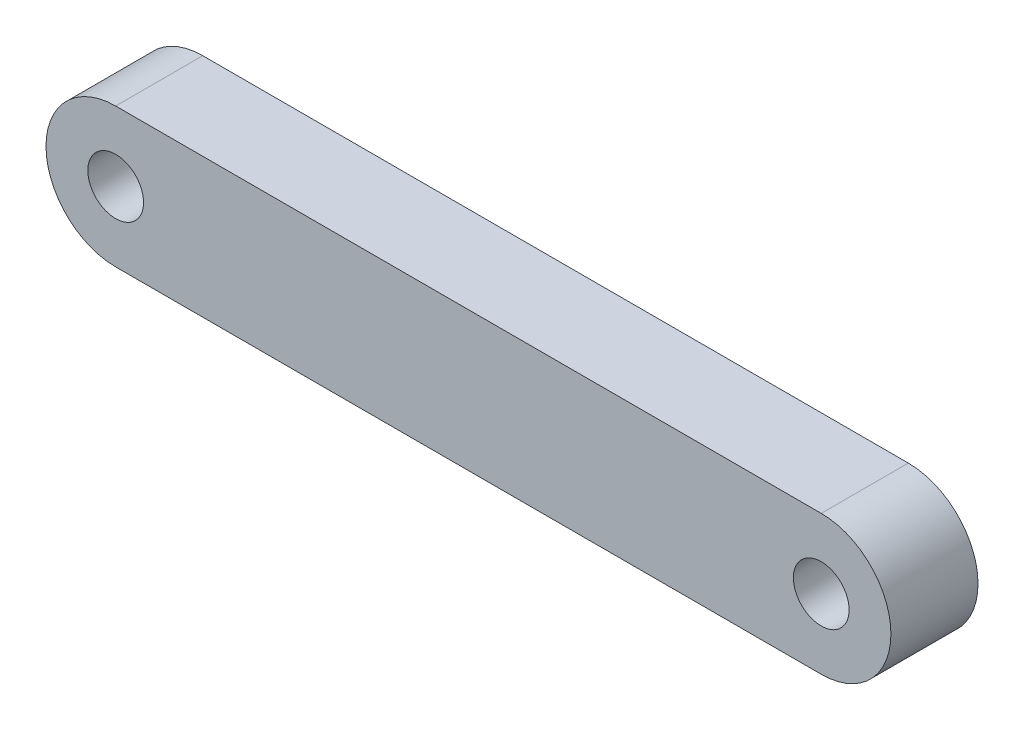
ISO-10303-21;
HEADER;
FILE_DESCRIPTION(('STEP AP214'),'2;1');
FILE_NAME('part.step','',(''),(''),'','','');
FILE_SCHEMA(('AUTOMOTIVE_DESIGN { 1 0 10303 214 1 1 1 1 }'));
ENDSEC;
DATA;
#1=APPLICATION_CONTEXT('core data for automotive mechanical design processes');
#2=APPLICATION_PROTOCOL_DEFINITION('international standard','automotive_design',2000,#1);
#3=PRODUCT_CONTEXT('',#1,'mechanical');
#4=PRODUCT('Part','Part','',(#3));
#5=PRODUCT_RELATED_PRODUCT_CATEGORY('part','',(#4));
#6=PRODUCT_DEFINITION_FORMATION('','',#4);
#7=PRODUCT_DEFINITION_CONTEXT('part definition',#1,'design');
#8=PRODUCT_DEFINITION('design','',#6,#7);
#9=PRODUCT_DEFINITION_SHAPE('','',#8);
#10=(LENGTH_UNIT() NAMED_UNIT(*) SI_UNIT(.MILLI.,.METRE.));
#11=(NAMED_UNIT(*) PLANE_ANGLE_UNIT() SI_UNIT($,.RADIAN.));
#12=(NAMED_UNIT(*) SI_UNIT($,.STERADIAN.) SOLID_ANGLE_UNIT());
#13=UNCERTAINTY_MEASURE_WITH_UNIT(LENGTH_MEASURE(1.E-05),#10,'distance_accuracy_value','');
#14=(GEOMETRIC_REPRESENTATION_CONTEXT(3) GLOBAL_UNCERTAINTY_ASSIGNED_CONTEXT((#13)) GLOBAL_UNIT_ASSIGNED_CONTEXT((#10,
#11,#12)) REPRESENTATION_CONTEXT('',''));
#15=CARTESIAN_POINT('',(0.,0.,0.));
#16=DIRECTION('',(0.,0.,1.));
#17=DIRECTION('',(1.,0.,0.));
#18=AXIS2_PLACEMENT_3D('',#15,#16,#17);
#19=CARTESIAN_POINT('',(4.,3.99999999999998,5.));
#20=DIRECTION('',(0.,0.,-1.));
#21=DIRECTION('',(-1.,0.,0.));
#22=AXIS2_PLACEMENT_3D('',#19,#20,#21);
#23=CYLINDRICAL_SURFACE('',#22,4.);
#24=CARTESIAN_POINT('',(4.,3.99999999999998,0.));
#25=DIRECTION('',(0.,0.,1.));
#26=DIRECTION('',(1.,0.,0.));
#27=AXIS2_PLACEMENT_3D('',#24,#25,#26);
#28=CIRCLE('',#27,4.);
#29=CARTESIAN_POINT('',(4.,8.,0.));
#30=VERTEX_POINT('',#29);
#31=CARTESIAN_POINT('',(4.,0.,0.));
#32=VERTEX_POINT('',#31);
#33=EDGE_CURVE('E99',#30,#32,#28,.T.);
#34=ORIENTED_EDGE('',*,*,#33,.T.);
#35=DIRECTION('',(0.,0.,-1.));
#36=VECTOR('',#35,1.);
#37=CARTESIAN_POINT('',(4.,0.,5.));
#38=LINE('',#37,#36);
#39=CARTESIAN_POINT('',(4.,0.,5.));
#40=VERTEX_POINT('',#39);
#41=EDGE_CURVE('E11',#40,#32,#38,.T.);
#42=ORIENTED_EDGE('',*,*,#41,.F.);
#43=CARTESIAN_POINT('',(4.,3.99999999999998,5.));
#44=DIRECTION('',(0.,0.,1.));
#45=DIRECTION('',(1.,0.,0.));
#46=AXIS2_PLACEMENT_3D('',#43,#44,#45);
#47=CIRCLE('',#46,4.);
#48=CARTESIAN_POINT('',(4.,8.,5.));
#49=VERTEX_POINT('',#48);
#50=EDGE_CURVE('E85',#49,#40,#47,.T.);
#51=ORIENTED_EDGE('',*,*,#50,.F.);
#52=DIRECTION('',(0.,0.,-1.));
#53=VECTOR('',#52,1.);
#54=CARTESIAN_POINT('',(4.,8.,5.));
#55=LINE('',#54,#53);
#56=EDGE_CURVE('E52',#49,#30,#55,.T.);
#57=ORIENTED_EDGE('',*,*,#56,.T.);
#58=EDGE_LOOP('',(#34,#42,#51,#57));
#59=FACE_BOUND('',#58,.T.);
#60=ADVANCED_FACE('F36',(#59),#23,.T.);
#61=CARTESIAN_POINT('',(4.,0.,5.));
#62=DIRECTION('',(0.,1.,0.));
#63=DIRECTION('',(-1.,0.,0.));
#64=AXIS2_PLACEMENT_3D('',#61,#62,#63);
#65=PLANE('',#64);
#66=DIRECTION('',(1.,0.,0.));
#67=VECTOR('',#66,1.);
#68=CARTESIAN_POINT('',(4.,0.,0.));
#69=LINE('',#68,#67);
#70=CARTESIAN_POINT('',(44.5,0.,0.));
#71=VERTEX_POINT('',#70);
#72=EDGE_CURVE('E90',#32,#71,#69,.T.);
#73=ORIENTED_EDGE('',*,*,#72,.T.);
#74=DIRECTION('',(0.,0.,-1.));
#75=VECTOR('',#74,1.);
#76=CARTESIAN_POINT('',(44.5,0.,5.));
#77=LINE('',#76,#75);
#78=CARTESIAN_POINT('',(44.5,0.,5.));
#79=VERTEX_POINT('',#78);
#80=EDGE_CURVE('E44',#79,#71,#77,.T.);
#81=ORIENTED_EDGE('',*,*,#80,.F.);
#82=DIRECTION('',(1.,0.,0.));
#83=VECTOR('',#82,1.);
#84=CARTESIAN_POINT('',(4.,0.,5.));
#85=LINE('',#84,#83);
#86=EDGE_CURVE('E78',#40,#79,#85,.T.);
#87=ORIENTED_EDGE('',*,*,#86,.F.);
#88=ORIENTED_EDGE('',*,*,#41,.T.);
#89=EDGE_LOOP('',(#73,#81,#87,#88));
#90=FACE_BOUND('',#89,.T.);
#91=ADVANCED_FACE('F89',(#90),#65,.F.);
#92=CARTESIAN_POINT('',(44.5,4.,5.));
#93=DIRECTION('',(0.,0.,-1.));
#94=DIRECTION('',(-1.,0.,0.));
#95=AXIS2_PLACEMENT_3D('',#92,#93,#94);
#96=CYLINDRICAL_SURFACE('',#95,4.);
#97=CARTESIAN_POINT('',(44.5,4.,0.));
#98=DIRECTION('',(0.,0.,1.));
#99=DIRECTION('',(1.,0.,0.));
#100=AXIS2_PLACEMENT_3D('',#97,#98,#99);
#101=CIRCLE('',#100,4.);
#102=CARTESIAN_POINT('',(44.5,8.,0.));
#103=VERTEX_POINT('',#102);
#104=EDGE_CURVE('E103',#71,#103,#101,.T.);
#105=ORIENTED_EDGE('',*,*,#104,.T.);
#106=DIRECTION('',(0.,0.,-1.));
#107=VECTOR('',#106,1.);
#108=CARTESIAN_POINT('',(44.5,8.,5.));
#109=LINE('',#108,#107);
#110=CARTESIAN_POINT('',(44.5,8.,5.));
#111=VERTEX_POINT('',#110);
#112=EDGE_CURVE('E67',#111,#103,#109,.T.);
#113=ORIENTED_EDGE('',*,*,#112,.F.);
#114=CARTESIAN_POINT('',(44.5,4.,5.));
#115=DIRECTION('',(0.,0.,1.));
#116=DIRECTION('',(1.,0.,0.));
#117=AXIS2_PLACEMENT_3D('',#114,#115,#116);
#118=CIRCLE('',#117,4.);
#119=EDGE_CURVE('E84',#79,#111,#118,.T.);
#120=ORIENTED_EDGE('',*,*,#119,.F.);
#121=ORIENTED_EDGE('',*,*,#80,.T.);
#122=EDGE_LOOP('',(#105,#113,#120,#121));
#123=FACE_BOUND('',#122,.T.);
#124=ADVANCED_FACE('F93',(#123),#96,.T.);
#125=CARTESIAN_POINT('',(4.,8.,5.));
#126=DIRECTION('',(0.,1.,0.));
#127=DIRECTION('',(-1.,0.,0.));
#128=AXIS2_PLACEMENT_3D('',#125,#126,#127);
#129=PLANE('',#128);
#130=DIRECTION('',(1.,0.,0.));
#131=VECTOR('',#130,1.);
#132=CARTESIAN_POINT('',(4.,8.,0.));
#133=LINE('',#132,#131);
#134=EDGE_CURVE('E105',#30,#103,#133,.T.);
#135=ORIENTED_EDGE('',*,*,#134,.F.);
#136=ORIENTED_EDGE('',*,*,#56,.F.);
#137=DIRECTION('',(1.,0.,0.));
#138=VECTOR('',#137,1.);
#139=CARTESIAN_POINT('',(4.,8.,5.));
#140=LINE('',#139,#138);
#141=EDGE_CURVE('E94',#49,#111,#140,.T.);
#142=ORIENTED_EDGE('',*,*,#141,.T.);
#143=ORIENTED_EDGE('',*,*,#112,.T.);
#144=EDGE_LOOP('',(#135,#136,#142,#143));
#145=FACE_BOUND('',#144,.T.);
#146=ADVANCED_FACE('F129',(#145),#129,.T.);
#147=CARTESIAN_POINT('',(4.,3.99999999999998,5.));
#148=DIRECTION('',(0.,0.,1.));
#149=DIRECTION('',(1.,0.,0.));
#150=AXIS2_PLACEMENT_3D('',#147,#148,#149);
#151=PLANE('',#150);
#152=CARTESIAN_POINT('',(4.,3.99999999999998,5.));
#153=DIRECTION('',(0.,0.,1.));
#154=DIRECTION('',(1.,0.,0.));
#155=AXIS2_PLACEMENT_3D('',#152,#153,#154);
#156=CIRCLE('',#155,1.6);
#157=CARTESIAN_POINT('',(5.6,3.99999999999998,5.));
#158=VERTEX_POINT('',#157);
#159=EDGE_CURVE('E101',#158,#158,#156,.T.);
#160=ORIENTED_EDGE('',*,*,#159,.F.);
#161=EDGE_LOOP('',(#160));
#162=FACE_BOUND('',#161,.T.);
#163=CARTESIAN_POINT('',(44.5,4.,5.));
#164=DIRECTION('',(0.,0.,1.));
#165=DIRECTION('',(1.,0.,0.));
#166=AXIS2_PLACEMENT_3D('',#163,#164,#165);
#167=CIRCLE('',#166,1.6);
#168=CARTESIAN_POINT('',(46.1,4.,5.));
#169=VERTEX_POINT('',#168);
#170=EDGE_CURVE('E114',#169,#169,#167,.T.);
#171=ORIENTED_EDGE('',*,*,#170,.F.);
#172=EDGE_LOOP('',(#171));
#173=FACE_BOUND('',#172,.T.);
#174=ORIENTED_EDGE('',*,*,#50,.T.);
#175=ORIENTED_EDGE('',*,*,#86,.T.);
#176=ORIENTED_EDGE('',*,*,#119,.T.);
#177=ORIENTED_EDGE('',*,*,#141,.F.);
#178=EDGE_LOOP('',(#174,#175,#176,#177));
#179=FACE_BOUND('',#178,.T.);
#180=ADVANCED_FACE('F81',(#162,#173,#179),#151,.T.);
#181=CARTESIAN_POINT('',(4.,3.99999999999998,0.));
#182=DIRECTION('',(0.,0.,1.));
#183=DIRECTION('',(1.,0.,0.));
#184=AXIS2_PLACEMENT_3D('',#181,#182,#183);
#185=PLANE('',#184);
#186=CARTESIAN_POINT('',(4.,3.99999999999998,0.));
#187=DIRECTION('',(0.,0.,1.));
#188=DIRECTION('',(1.,0.,0.));
#189=AXIS2_PLACEMENT_3D('',#186,#187,#188);
#190=CIRCLE('',#189,1.6);
#191=CARTESIAN_POINT('',(5.6,3.99999999999998,0.));
#192=VERTEX_POINT('',#191);
#193=EDGE_CURVE('E117',#192,#192,#190,.T.);
#194=ORIENTED_EDGE('',*,*,#193,.T.);
#195=EDGE_LOOP('',(#194));
#196=FACE_BOUND('',#195,.T.);
#197=CARTESIAN_POINT('',(44.5,4.,0.));
#198=DIRECTION('',(0.,0.,1.));
#199=DIRECTION('',(1.,0.,0.));
#200=AXIS2_PLACEMENT_3D('',#197,#198,#199);
#201=CIRCLE('',#200,1.6);
#202=CARTESIAN_POINT('',(46.1,4.,0.));
#203=VERTEX_POINT('',#202);
#204=EDGE_CURVE('E111',#203,#203,#201,.T.);
#205=ORIENTED_EDGE('',*,*,#204,.T.);
#206=EDGE_LOOP('',(#205));
#207=FACE_BOUND('',#206,.T.);
#208=ORIENTED_EDGE('',*,*,#33,.F.);
#209=ORIENTED_EDGE('',*,*,#134,.T.);
#210=ORIENTED_EDGE('',*,*,#104,.F.);
#211=ORIENTED_EDGE('',*,*,#72,.F.);
#212=EDGE_LOOP('',(#208,#209,#210,#211));
#213=FACE_BOUND('',#212,.T.);
#214=ADVANCED_FACE('F128',(#196,#207,#213),#185,.F.);
#215=CARTESIAN_POINT('',(44.5,4.,5.));
#216=DIRECTION('',(0.,0.,-1.));
#217=DIRECTION('',(-1.,0.,0.));
#218=AXIS2_PLACEMENT_3D('',#215,#216,#217);
#219=CYLINDRICAL_SURFACE('',#218,1.6);
#220=ORIENTED_EDGE('',*,*,#170,.T.);
#221=EDGE_LOOP('',(#220));
#222=FACE_BOUND('',#221,.T.);
#223=ORIENTED_EDGE('',*,*,#204,.F.);
#224=EDGE_LOOP('',(#223));
#225=FACE_BOUND('',#224,.T.);
#226=ADVANCED_FACE('F133',(#222,#225),#219,.F.);
#227=CARTESIAN_POINT('',(4.,3.99999999999998,5.));
#228=DIRECTION('',(0.,0.,-1.));
#229=DIRECTION('',(-1.,0.,0.));
#230=AXIS2_PLACEMENT_3D('',#227,#228,#229);
#231=CYLINDRICAL_SURFACE('',#230,1.6);
#232=ORIENTED_EDGE('',*,*,#159,.T.);
#233=EDGE_LOOP('',(#232));
#234=FACE_BOUND('',#233,.T.);
#235=ORIENTED_EDGE('',*,*,#193,.F.);
#236=EDGE_LOOP('',(#235));
#237=FACE_BOUND('',#236,.T.);
#238=ADVANCED_FACE('F123',(#234,#237),#231,.F.);
#239=CLOSED_SHELL('',(#60,#91,#124,#146,#180,#214,#226,#238));
#240=MANIFOLD_SOLID_BREP('B2',#239);
#241=ADVANCED_BREP_SHAPE_REPRESENTATION('',(#18,#240),#14);
#242=SHAPE_DEFINITION_REPRESENTATION(#9,#241);
ENDSEC;
END-ISO-10303-21;
